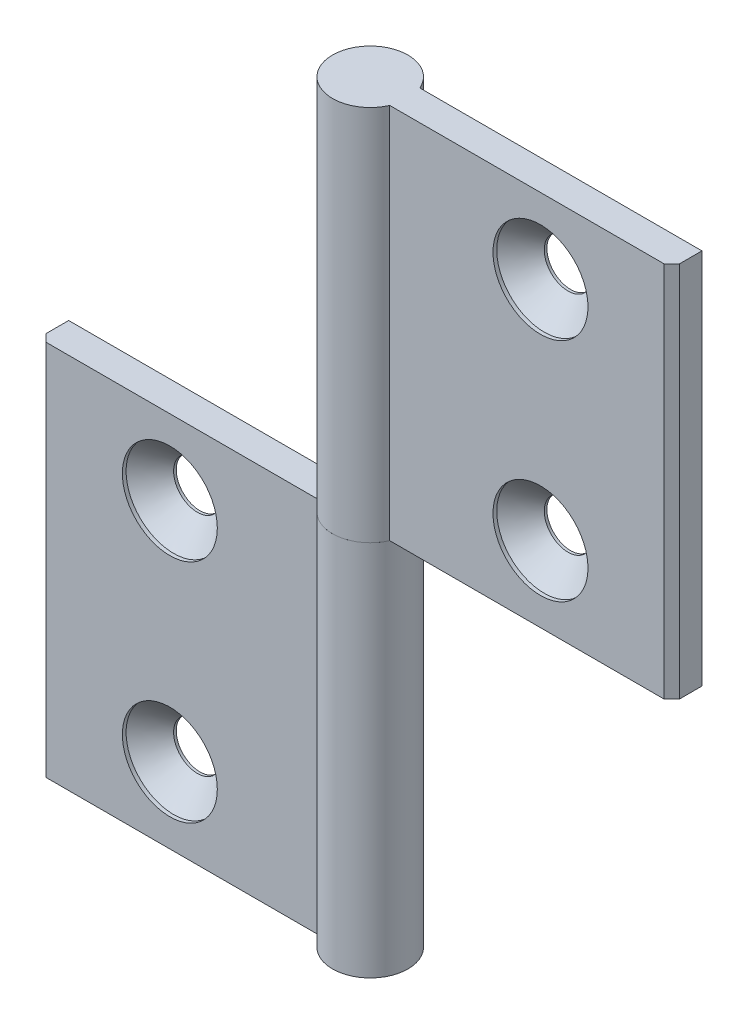
ISO-10303-21;
HEADER;
FILE_DESCRIPTION(('STEP AP214'),'2;1');
FILE_NAME('part.step','',(''),(''),'','','');
FILE_SCHEMA(('AUTOMOTIVE_DESIGN { 1 0 10303 214 1 1 1 1 }'));
ENDSEC;
DATA;
#1=APPLICATION_CONTEXT('core data for automotive mechanical design processes');
#2=APPLICATION_PROTOCOL_DEFINITION('international standard','automotive_design',2000,#1);
#3=PRODUCT_CONTEXT('',#1,'mechanical');
#4=PRODUCT('Part','Part','',(#3));
#5=PRODUCT_RELATED_PRODUCT_CATEGORY('part','',(#4));
#6=PRODUCT_DEFINITION_FORMATION('','',#4);
#7=PRODUCT_DEFINITION_CONTEXT('part definition',#1,'design');
#8=PRODUCT_DEFINITION('design','',#6,#7);
#9=PRODUCT_DEFINITION_SHAPE('','',#8);
#10=(LENGTH_UNIT() NAMED_UNIT(*) SI_UNIT(.MILLI.,.METRE.));
#11=(NAMED_UNIT(*) PLANE_ANGLE_UNIT() SI_UNIT($,.RADIAN.));
#12=(NAMED_UNIT(*) SI_UNIT($,.STERADIAN.) SOLID_ANGLE_UNIT());
#13=UNCERTAINTY_MEASURE_WITH_UNIT(LENGTH_MEASURE(1.E-05),#10,'distance_accuracy_value','');
#14=(GEOMETRIC_REPRESENTATION_CONTEXT(3) GLOBAL_UNCERTAINTY_ASSIGNED_CONTEXT((#13)) GLOBAL_UNIT_ASSIGNED_CONTEXT((#10,
#11,#12)) REPRESENTATION_CONTEXT('',''));
#15=CARTESIAN_POINT('',(0.,0.,0.));
#16=DIRECTION('',(0.,0.,1.));
#17=DIRECTION('',(1.,0.,0.));
#18=AXIS2_PLACEMENT_3D('',#15,#16,#17);
#19=CARTESIAN_POINT('',(0.,25.,0.));
#20=DIRECTION('',(0.,1.,0.));
#21=DIRECTION('',(0.,0.,-1.));
#22=AXIS2_PLACEMENT_3D('',#19,#20,#21);
#23=CYLINDRICAL_SURFACE('',#22,5.);
#24=CARTESIAN_POINT('',(0.,75.,0.));
#25=DIRECTION('',(0.,-1.,0.));
#26=DIRECTION('',(0.,0.,1.));
#27=AXIS2_PLACEMENT_3D('',#24,#25,#26);
#28=CIRCLE('',#27,5.);
#29=CARTESIAN_POINT('',(4.58257569495585,75.,1.99999999999997));
#30=VERTEX_POINT('',#29);
#31=CARTESIAN_POINT('',(4.58257569495582,75.,-2.00000000000004));
#32=VERTEX_POINT('',#31);
#33=EDGE_CURVE('E120',#30,#32,#28,.T.);
#34=ORIENTED_EDGE('',*,*,#33,.T.);
#35=DIRECTION('',(0.,1.,0.));
#36=VECTOR('',#35,1.);
#37=CARTESIAN_POINT('',(4.58257569495582,25.,-2.00000000000004));
#38=LINE('',#37,#36);
#39=CARTESIAN_POINT('',(4.58257569495582,25.,-2.00000000000004));
#40=VERTEX_POINT('',#39);
#41=EDGE_CURVE('E12',#40,#32,#38,.T.);
#42=ORIENTED_EDGE('',*,*,#41,.F.);
#43=CARTESIAN_POINT('',(0.,25.,0.));
#44=DIRECTION('',(0.,-1.,0.));
#45=DIRECTION('',(0.,0.,1.));
#46=AXIS2_PLACEMENT_3D('',#43,#44,#45);
#47=CIRCLE('',#46,5.);
#48=CARTESIAN_POINT('',(4.58257569495585,25.,1.99999999999997));
#49=VERTEX_POINT('',#48);
#50=EDGE_CURVE('E129',#49,#40,#47,.T.);
#51=ORIENTED_EDGE('',*,*,#50,.F.);
#52=DIRECTION('',(0.,1.,0.));
#53=VECTOR('',#52,1.);
#54=CARTESIAN_POINT('',(4.58257569495585,25.,1.99999999999997));
#55=LINE('',#54,#53);
#56=EDGE_CURVE('E116',#49,#30,#55,.T.);
#57=ORIENTED_EDGE('',*,*,#56,.T.);
#58=EDGE_LOOP('',(#34,#42,#51,#57));
#59=FACE_BOUND('',#58,.T.);
#60=ADVANCED_FACE('F44',(#59),#23,.T.);
#61=CARTESIAN_POINT('',(4.58257569495582,25.,-2.00000000000004));
#62=DIRECTION('',(0.,0.,1.));
#63=DIRECTION('',(-1.,0.,0.));
#64=AXIS2_PLACEMENT_3D('',#61,#62,#63);
#65=PLANE('',#64);
#66=CARTESIAN_POINT('',(24.5825756949558,35.,-2.00000000000018));
#67=DIRECTION('',(0.,0.,1.));
#68=DIRECTION('',(-1.,0.,0.));
#69=AXIS2_PLACEMENT_3D('',#66,#67,#68);
#70=CIRCLE('',#69,3.15);
#71=CARTESIAN_POINT('',(21.4325756949558,35.,-2.00000000000016));
#72=VERTEX_POINT('',#71);
#73=EDGE_CURVE('E47',#72,#72,#70,.T.);
#74=ORIENTED_EDGE('',*,*,#73,.T.);
#75=EDGE_LOOP('',(#74));
#76=FACE_BOUND('',#75,.T.);
#77=CARTESIAN_POINT('',(24.5825756949558,65.,-2.00000000000018));
#78=DIRECTION('',(0.,0.,1.));
#79=DIRECTION('',(-1.,0.,0.));
#80=AXIS2_PLACEMENT_3D('',#77,#78,#79);
#81=CIRCLE('',#80,3.15);
#82=CARTESIAN_POINT('',(21.4325756949558,65.,-2.00000000000016));
#83=VERTEX_POINT('',#82);
#84=EDGE_CURVE('E124',#83,#83,#81,.T.);
#85=ORIENTED_EDGE('',*,*,#84,.T.);
#86=EDGE_LOOP('',(#85));
#87=FACE_BOUND('',#86,.T.);
#88=DIRECTION('',(1.,0.,0.));
#89=VECTOR('',#88,1.);
#90=CARTESIAN_POINT('',(4.58257569495582,75.,-2.00000000000004));
#91=LINE('',#90,#89);
#92=CARTESIAN_POINT('',(42.,75.,-2.00000000000031));
#93=VERTEX_POINT('',#92);
#94=EDGE_CURVE('E123',#32,#93,#91,.T.);
#95=ORIENTED_EDGE('',*,*,#94,.T.);
#96=DIRECTION('',(0.,1.,0.));
#97=VECTOR('',#96,1.);
#98=CARTESIAN_POINT('',(42.,25.,-2.00000000000031));
#99=LINE('',#98,#97);
#100=CARTESIAN_POINT('',(42.,25.,-2.00000000000031));
#101=VERTEX_POINT('',#100);
#102=EDGE_CURVE('E53',#101,#93,#99,.T.);
#103=ORIENTED_EDGE('',*,*,#102,.F.);
#104=DIRECTION('',(1.,0.,0.));
#105=VECTOR('',#104,1.);
#106=CARTESIAN_POINT('',(4.58257569495582,25.,-2.00000000000004));
#107=LINE('',#106,#105);
#108=EDGE_CURVE('E96',#40,#101,#107,.T.);
#109=ORIENTED_EDGE('',*,*,#108,.F.);
#110=ORIENTED_EDGE('',*,*,#41,.T.);
#111=EDGE_LOOP('',(#95,#103,#109,#110));
#112=FACE_BOUND('',#111,.T.);
#113=ADVANCED_FACE('F150',(#76,#87,#112),#65,.F.);
#114=CARTESIAN_POINT('',(42.,25.,-2.00000000000031));
#115=DIRECTION('',(-1.,0.,0.));
#116=DIRECTION('',(0.,0.,-1.));
#117=AXIS2_PLACEMENT_3D('',#114,#115,#116);
#118=PLANE('',#117);
#119=DIRECTION('',(0.,0.,1.));
#120=VECTOR('',#119,1.);
#121=CARTESIAN_POINT('',(42.,75.,-2.00000000000031));
#122=LINE('',#121,#120);
#123=CARTESIAN_POINT('',(42.,75.,0.99999999999969));
#124=VERTEX_POINT('',#123);
#125=EDGE_CURVE('E111',#93,#124,#122,.T.);
#126=ORIENTED_EDGE('',*,*,#125,.T.);
#127=DIRECTION('',(0.,1.,0.));
#128=VECTOR('',#127,1.);
#129=CARTESIAN_POINT('',(42.,25.,0.99999999999969));
#130=LINE('',#129,#128);
#131=CARTESIAN_POINT('',(42.,25.,0.99999999999969));
#132=VERTEX_POINT('',#131);
#133=EDGE_CURVE('E108',#132,#124,#130,.T.);
#134=ORIENTED_EDGE('',*,*,#133,.F.);
#135=DIRECTION('',(0.,0.,1.));
#136=VECTOR('',#135,1.);
#137=CARTESIAN_POINT('',(42.,25.,-2.00000000000031));
#138=LINE('',#137,#136);
#139=EDGE_CURVE('E100',#101,#132,#138,.T.);
#140=ORIENTED_EDGE('',*,*,#139,.F.);
#141=ORIENTED_EDGE('',*,*,#102,.T.);
#142=EDGE_LOOP('',(#126,#134,#140,#141));
#143=FACE_BOUND('',#142,.T.);
#144=ADVANCED_FACE('F109',(#143),#118,.F.);
#145=CARTESIAN_POINT('',(42.,25.,0.99999999999969));
#146=DIRECTION('',(-0.70710678118655,0.,-0.707106781186545));
#147=DIRECTION('',(0.707106781186545,0.,-0.70710678118655));
#148=AXIS2_PLACEMENT_3D('',#145,#146,#147);
#149=PLANE('',#148);
#150=DIRECTION('',(-0.707106781186545,0.,0.70710678118655));
#151=VECTOR('',#150,1.);
#152=CARTESIAN_POINT('',(42.,75.,0.99999999999969));
#153=LINE('',#152,#151);
#154=CARTESIAN_POINT('',(41.,75.,1.99999999999969));
#155=VERTEX_POINT('',#154);
#156=EDGE_CURVE('E82',#124,#155,#153,.T.);
#157=ORIENTED_EDGE('',*,*,#156,.T.);
#158=DIRECTION('',(0.,1.,0.));
#159=VECTOR('',#158,1.);
#160=CARTESIAN_POINT('',(41.,25.,1.99999999999969));
#161=LINE('',#160,#159);
#162=CARTESIAN_POINT('',(41.,25.,1.99999999999969));
#163=VERTEX_POINT('',#162);
#164=EDGE_CURVE('E112',#163,#155,#161,.T.);
#165=ORIENTED_EDGE('',*,*,#164,.F.);
#166=DIRECTION('',(-0.707106781186545,0.,0.70710678118655));
#167=VECTOR('',#166,1.);
#168=CARTESIAN_POINT('',(42.,25.,0.99999999999969));
#169=LINE('',#168,#167);
#170=EDGE_CURVE('E104',#132,#163,#169,.T.);
#171=ORIENTED_EDGE('',*,*,#170,.F.);
#172=ORIENTED_EDGE('',*,*,#133,.T.);
#173=EDGE_LOOP('',(#157,#165,#171,#172));
#174=FACE_BOUND('',#173,.T.);
#175=ADVANCED_FACE('F114',(#174),#149,.F.);
#176=CARTESIAN_POINT('',(41.,25.,1.99999999999969));
#177=DIRECTION('',(0.,0.,-1.));
#178=DIRECTION('',(1.,0.,0.));
#179=AXIS2_PLACEMENT_3D('',#176,#177,#178);
#180=PLANE('',#179);
#181=CARTESIAN_POINT('',(24.5825756949558,35.,1.99999999999982));
#182=DIRECTION('',(0.,0.,1.));
#183=DIRECTION('',(-1.,0.,0.));
#184=AXIS2_PLACEMENT_3D('',#181,#182,#183);
#185=CIRCLE('',#184,6.3);
#186=CARTESIAN_POINT('',(18.2825756949558,35.,1.99999999999987));
#187=VERTEX_POINT('',#186);
#188=EDGE_CURVE('E184',#187,#187,#185,.T.);
#189=ORIENTED_EDGE('',*,*,#188,.F.);
#190=EDGE_LOOP('',(#189));
#191=FACE_BOUND('',#190,.T.);
#192=CARTESIAN_POINT('',(24.5825756949558,65.,1.99999999999982));
#193=DIRECTION('',(0.,0.,1.));
#194=DIRECTION('',(-1.,0.,0.));
#195=AXIS2_PLACEMENT_3D('',#192,#193,#194);
#196=CIRCLE('',#195,6.3);
#197=CARTESIAN_POINT('',(18.2825756949558,65.,1.99999999999987));
#198=VERTEX_POINT('',#197);
#199=EDGE_CURVE('E142',#198,#198,#196,.T.);
#200=ORIENTED_EDGE('',*,*,#199,.F.);
#201=EDGE_LOOP('',(#200));
#202=FACE_BOUND('',#201,.T.);
#203=DIRECTION('',(-1.,0.,0.));
#204=VECTOR('',#203,1.);
#205=CARTESIAN_POINT('',(41.,75.,1.99999999999969));
#206=LINE('',#205,#204);
#207=EDGE_CURVE('E88',#155,#30,#206,.T.);
#208=ORIENTED_EDGE('',*,*,#207,.T.);
#209=ORIENTED_EDGE('',*,*,#56,.F.);
#210=DIRECTION('',(-1.,0.,0.));
#211=VECTOR('',#210,1.);
#212=CARTESIAN_POINT('',(41.,25.,1.99999999999969));
#213=LINE('',#212,#211);
#214=EDGE_CURVE('E62',#163,#49,#213,.T.);
#215=ORIENTED_EDGE('',*,*,#214,.F.);
#216=ORIENTED_EDGE('',*,*,#164,.T.);
#217=EDGE_LOOP('',(#208,#209,#215,#216));
#218=FACE_BOUND('',#217,.T.);
#219=ADVANCED_FACE('F162',(#191,#202,#218),#180,.F.);
#220=CARTESIAN_POINT('',(0.,25.,0.));
#221=DIRECTION('',(0.,-1.,0.));
#222=DIRECTION('',(0.,0.,1.));
#223=AXIS2_PLACEMENT_3D('',#220,#221,#222);
#224=PLANE('',#223);
#225=ORIENTED_EDGE('',*,*,#50,.T.);
#226=ORIENTED_EDGE('',*,*,#108,.T.);
#227=ORIENTED_EDGE('',*,*,#139,.T.);
#228=ORIENTED_EDGE('',*,*,#170,.T.);
#229=ORIENTED_EDGE('',*,*,#214,.T.);
#230=EDGE_LOOP('',(#225,#226,#227,#228,#229));
#231=FACE_BOUND('',#230,.T.);
#232=ADVANCED_FACE('F102',(#231),#224,.T.);
#233=CARTESIAN_POINT('',(0.,75.,0.));
#234=DIRECTION('',(0.,-1.,0.));
#235=DIRECTION('',(0.,0.,1.));
#236=AXIS2_PLACEMENT_3D('',#233,#234,#235);
#237=PLANE('',#236);
#238=ORIENTED_EDGE('',*,*,#33,.F.);
#239=ORIENTED_EDGE('',*,*,#207,.F.);
#240=ORIENTED_EDGE('',*,*,#156,.F.);
#241=ORIENTED_EDGE('',*,*,#125,.F.);
#242=ORIENTED_EDGE('',*,*,#94,.F.);
#243=EDGE_LOOP('',(#238,#239,#240,#241,#242));
#244=FACE_BOUND('',#243,.T.);
#245=ADVANCED_FACE('F152',(#244),#237,.F.);
#246=CARTESIAN_POINT('',(24.5825756949558,65.,1.99999999999982));
#247=DIRECTION('',(0.,0.,1.));
#248=DIRECTION('',(-1.,0.,0.));
#249=AXIS2_PLACEMENT_3D('',#246,#247,#248);
#250=CYLINDRICAL_SURFACE('',#249,3.15);
#251=CARTESIAN_POINT('',(24.5825756949558,65.,-1.65000000000018));
#252=DIRECTION('',(0.,0.,1.));
#253=DIRECTION('',(-1.,0.,0.));
#254=AXIS2_PLACEMENT_3D('',#251,#252,#253);
#255=CIRCLE('',#254,3.15);
#256=CARTESIAN_POINT('',(21.4325756949558,65.,-1.65000000000016));
#257=VERTEX_POINT('',#256);
#258=EDGE_CURVE('E133',#257,#257,#255,.T.);
#259=ORIENTED_EDGE('',*,*,#258,.T.);
#260=EDGE_LOOP('',(#259));
#261=FACE_BOUND('',#260,.T.);
#262=ORIENTED_EDGE('',*,*,#84,.F.);
#263=EDGE_LOOP('',(#262));
#264=FACE_BOUND('',#263,.T.);
#265=ADVANCED_FACE('F154',(#261,#264),#250,.F.);
#266=CARTESIAN_POINT('',(24.5825756949558,65.,1.49999999999982));
#267=DIRECTION('',(0.,0.,1.));
#268=DIRECTION('',(-1.,0.,0.));
#269=AXIS2_PLACEMENT_3D('',#266,#267,#268);
#270=CONICAL_SURFACE('',#269,6.3,0.785398163397449);
#271=ORIENTED_EDGE('',*,*,#258,.F.);
#272=EDGE_LOOP('',(#271));
#273=FACE_BOUND('',#272,.T.);
#274=CARTESIAN_POINT('',(24.5825756949558,65.,1.49999999999982));
#275=DIRECTION('',(0.,0.,1.));
#276=DIRECTION('',(-1.,0.,0.));
#277=AXIS2_PLACEMENT_3D('',#274,#275,#276);
#278=CIRCLE('',#277,6.3);
#279=CARTESIAN_POINT('',(18.2825756949558,65.,1.49999999999986));
#280=VERTEX_POINT('',#279);
#281=EDGE_CURVE('E137',#280,#280,#278,.T.);
#282=ORIENTED_EDGE('',*,*,#281,.T.);
#283=EDGE_LOOP('',(#282));
#284=FACE_BOUND('',#283,.T.);
#285=ADVANCED_FACE('F160',(#273,#284),#270,.F.);
#286=CARTESIAN_POINT('',(24.5825756949558,65.,1.99999999999982));
#287=DIRECTION('',(0.,0.,1.));
#288=DIRECTION('',(-1.,0.,0.));
#289=AXIS2_PLACEMENT_3D('',#286,#287,#288);
#290=CYLINDRICAL_SURFACE('',#289,6.3);
#291=ORIENTED_EDGE('',*,*,#281,.F.);
#292=EDGE_LOOP('',(#291));
#293=FACE_BOUND('',#292,.T.);
#294=ORIENTED_EDGE('',*,*,#199,.T.);
#295=EDGE_LOOP('',(#294));
#296=FACE_BOUND('',#295,.T.);
#297=ADVANCED_FACE('F211',(#293,#296),#290,.F.);
#298=CARTESIAN_POINT('',(24.5825756949558,35.,1.99999999999982));
#299=DIRECTION('',(0.,0.,1.));
#300=DIRECTION('',(-1.,0.,0.));
#301=AXIS2_PLACEMENT_3D('',#298,#299,#300);
#302=CYLINDRICAL_SURFACE('',#301,3.15);
#303=CARTESIAN_POINT('',(24.5825756949558,35.,-1.65000000000018));
#304=DIRECTION('',(0.,0.,1.));
#305=DIRECTION('',(-1.,0.,0.));
#306=AXIS2_PLACEMENT_3D('',#303,#304,#305);
#307=CIRCLE('',#306,3.15);
#308=CARTESIAN_POINT('',(21.4325756949558,35.,-1.65000000000016));
#309=VERTEX_POINT('',#308);
#310=EDGE_CURVE('E188',#309,#309,#307,.T.);
#311=ORIENTED_EDGE('',*,*,#310,.T.);
#312=EDGE_LOOP('',(#311));
#313=FACE_BOUND('',#312,.T.);
#314=ORIENTED_EDGE('',*,*,#73,.F.);
#315=EDGE_LOOP('',(#314));
#316=FACE_BOUND('',#315,.T.);
#317=ADVANCED_FACE('F204',(#313,#316),#302,.F.);
#318=CARTESIAN_POINT('',(24.5825756949558,35.,1.49999999999982));
#319=DIRECTION('',(0.,0.,1.));
#320=DIRECTION('',(-1.,0.,0.));
#321=AXIS2_PLACEMENT_3D('',#318,#319,#320);
#322=CONICAL_SURFACE('',#321,6.3,0.785398163397449);
#323=ORIENTED_EDGE('',*,*,#310,.F.);
#324=EDGE_LOOP('',(#323));
#325=FACE_BOUND('',#324,.T.);
#326=CARTESIAN_POINT('',(24.5825756949558,35.,1.49999999999982));
#327=DIRECTION('',(0.,0.,1.));
#328=DIRECTION('',(-1.,0.,0.));
#329=AXIS2_PLACEMENT_3D('',#326,#327,#328);
#330=CIRCLE('',#329,6.3);
#331=CARTESIAN_POINT('',(18.2825756949558,35.,1.49999999999986));
#332=VERTEX_POINT('',#331);
#333=EDGE_CURVE('E192',#332,#332,#330,.T.);
#334=ORIENTED_EDGE('',*,*,#333,.T.);
#335=EDGE_LOOP('',(#334));
#336=FACE_BOUND('',#335,.T.);
#337=ADVANCED_FACE('F198',(#325,#336),#322,.F.);
#338=CARTESIAN_POINT('',(24.5825756949558,35.,1.99999999999982));
#339=DIRECTION('',(0.,0.,1.));
#340=DIRECTION('',(-1.,0.,0.));
#341=AXIS2_PLACEMENT_3D('',#338,#339,#340);
#342=CYLINDRICAL_SURFACE('',#341,6.3);
#343=ORIENTED_EDGE('',*,*,#333,.F.);
#344=EDGE_LOOP('',(#343));
#345=FACE_BOUND('',#344,.T.);
#346=ORIENTED_EDGE('',*,*,#188,.T.);
#347=EDGE_LOOP('',(#346));
#348=FACE_BOUND('',#347,.T.);
#349=ADVANCED_FACE('F196',(#345,#348),#342,.F.);
#350=CLOSED_SHELL('',(#60,#113,#144,#175,#219,#232,#245,#265,#285,#297,#317,#337,#349));
#351=MANIFOLD_SOLID_BREP('B2',#350);
#352=CARTESIAN_POINT('',(0.,25.,0.));
#353=DIRECTION('',(0.,-1.,0.));
#354=DIRECTION('',(0.,0.,-1.));
#355=AXIS2_PLACEMENT_3D('',#352,#353,#354);
#356=CYLINDRICAL_SURFACE('',#355,5.);
#357=CARTESIAN_POINT('',(0.,-25.,0.));
#358=DIRECTION('',(0.,1.,0.));
#359=DIRECTION('',(0.,0.,1.));
#360=AXIS2_PLACEMENT_3D('',#357,#358,#359);
#361=CIRCLE('',#360,5.);
#362=CARTESIAN_POINT('',(-4.58257569495584,-25.,2.));
#363=VERTEX_POINT('',#362);
#364=CARTESIAN_POINT('',(-4.58257569495584,-25.,-2.));
#365=VERTEX_POINT('',#364);
#366=EDGE_CURVE('E371',#363,#365,#361,.T.);
#367=ORIENTED_EDGE('',*,*,#366,.T.);
#368=DIRECTION('',(0.,-1.,0.));
#369=VECTOR('',#368,1.);
#370=CARTESIAN_POINT('',(-4.58257569495584,25.,-2.));
#371=LINE('',#370,#369);
#372=CARTESIAN_POINT('',(-4.58257569495584,25.,-2.));
#373=VERTEX_POINT('',#372);
#374=EDGE_CURVE('E42',#373,#365,#371,.T.);
#375=ORIENTED_EDGE('',*,*,#374,.F.);
#376=CARTESIAN_POINT('',(0.,25.,0.));
#377=DIRECTION('',(0.,1.,0.));
#378=DIRECTION('',(0.,0.,1.));
#379=AXIS2_PLACEMENT_3D('',#376,#377,#378);
#380=CIRCLE('',#379,5.);
#381=CARTESIAN_POINT('',(-4.58257569495584,25.,2.));
#382=VERTEX_POINT('',#381);
#383=EDGE_CURVE('E380',#382,#373,#380,.T.);
#384=ORIENTED_EDGE('',*,*,#383,.F.);
#385=DIRECTION('',(0.,-1.,0.));
#386=VECTOR('',#385,1.);
#387=CARTESIAN_POINT('',(-4.58257569495584,25.,2.));
#388=LINE('',#387,#386);
#389=EDGE_CURVE('E367',#382,#363,#388,.T.);
#390=ORIENTED_EDGE('',*,*,#389,.T.);
#391=EDGE_LOOP('',(#367,#375,#384,#390));
#392=FACE_BOUND('',#391,.T.);
#393=ADVANCED_FACE('F295',(#392),#356,.T.);
#394=CARTESIAN_POINT('',(-4.58257569495584,25.,-2.));
#395=DIRECTION('',(0.,0.,1.));
#396=DIRECTION('',(1.,0.,0.));
#397=AXIS2_PLACEMENT_3D('',#394,#395,#396);
#398=PLANE('',#397);
#399=CARTESIAN_POINT('',(-24.5825756949558,15.,-2.));
#400=DIRECTION('',(0.,0.,1.));
#401=DIRECTION('',(1.,0.,0.));
#402=AXIS2_PLACEMENT_3D('',#399,#400,#401);
#403=CIRCLE('',#402,3.15);
#404=CARTESIAN_POINT('',(-21.4325756949558,15.,-2.));
#405=VERTEX_POINT('',#404);
#406=EDGE_CURVE('E298',#405,#405,#403,.T.);
#407=ORIENTED_EDGE('',*,*,#406,.T.);
#408=EDGE_LOOP('',(#407));
#409=FACE_BOUND('',#408,.T.);
#410=CARTESIAN_POINT('',(-24.5825756949558,-15.,-2.));
#411=DIRECTION('',(0.,0.,1.));
#412=DIRECTION('',(1.,0.,0.));
#413=AXIS2_PLACEMENT_3D('',#410,#411,#412);
#414=CIRCLE('',#413,3.15);
#415=CARTESIAN_POINT('',(-21.4325756949558,-15.,-2.));
#416=VERTEX_POINT('',#415);
#417=EDGE_CURVE('E375',#416,#416,#414,.T.);
#418=ORIENTED_EDGE('',*,*,#417,.T.);
#419=EDGE_LOOP('',(#418));
#420=FACE_BOUND('',#419,.T.);
#421=DIRECTION('',(-1.,0.,0.));
#422=VECTOR('',#421,1.);
#423=CARTESIAN_POINT('',(-4.58257569495584,-25.,-2.));
#424=LINE('',#423,#422);
#425=CARTESIAN_POINT('',(-42.,-25.,-2.));
#426=VERTEX_POINT('',#425);
#427=EDGE_CURVE('E374',#365,#426,#424,.T.);
#428=ORIENTED_EDGE('',*,*,#427,.T.);
#429=DIRECTION('',(0.,-1.,0.));
#430=VECTOR('',#429,1.);
#431=CARTESIAN_POINT('',(-42.,25.,-2.));
#432=LINE('',#431,#430);
#433=CARTESIAN_POINT('',(-42.,25.,-2.));
#434=VERTEX_POINT('',#433);
#435=EDGE_CURVE('E304',#434,#426,#432,.T.);
#436=ORIENTED_EDGE('',*,*,#435,.F.);
#437=DIRECTION('',(-1.,0.,0.));
#438=VECTOR('',#437,1.);
#439=CARTESIAN_POINT('',(-4.58257569495584,25.,-2.));
#440=LINE('',#439,#438);
#441=EDGE_CURVE('E347',#373,#434,#440,.T.);
#442=ORIENTED_EDGE('',*,*,#441,.F.);
#443=ORIENTED_EDGE('',*,*,#374,.T.);
#444=EDGE_LOOP('',(#428,#436,#442,#443));
#445=FACE_BOUND('',#444,.T.);
#446=ADVANCED_FACE('F401',(#409,#420,#445),#398,.F.);
#447=CARTESIAN_POINT('',(-42.,25.,-2.));
#448=DIRECTION('',(1.,0.,0.));
#449=DIRECTION('',(0.,0.,-1.));
#450=AXIS2_PLACEMENT_3D('',#447,#448,#449);
#451=PLANE('',#450);
#452=DIRECTION('',(0.,0.,1.));
#453=VECTOR('',#452,1.);
#454=CARTESIAN_POINT('',(-42.,-25.,-2.));
#455=LINE('',#454,#453);
#456=CARTESIAN_POINT('',(-42.,-25.,1.));
#457=VERTEX_POINT('',#456);
#458=EDGE_CURVE('E362',#426,#457,#455,.T.);
#459=ORIENTED_EDGE('',*,*,#458,.T.);
#460=DIRECTION('',(0.,-1.,0.));
#461=VECTOR('',#460,1.);
#462=CARTESIAN_POINT('',(-42.,25.,1.));
#463=LINE('',#462,#461);
#464=CARTESIAN_POINT('',(-42.,25.,1.));
#465=VERTEX_POINT('',#464);
#466=EDGE_CURVE('E359',#465,#457,#463,.T.);
#467=ORIENTED_EDGE('',*,*,#466,.F.);
#468=DIRECTION('',(0.,0.,1.));
#469=VECTOR('',#468,1.);
#470=CARTESIAN_POINT('',(-42.,25.,-2.));
#471=LINE('',#470,#469);
#472=EDGE_CURVE('E351',#434,#465,#471,.T.);
#473=ORIENTED_EDGE('',*,*,#472,.F.);
#474=ORIENTED_EDGE('',*,*,#435,.T.);
#475=EDGE_LOOP('',(#459,#467,#473,#474));
#476=FACE_BOUND('',#475,.T.);
#477=ADVANCED_FACE('F360',(#476),#451,.F.);
#478=CARTESIAN_POINT('',(-42.,25.,1.));
#479=DIRECTION('',(0.707106781186544,0.,-0.707106781186551));
#480=DIRECTION('',(-0.707106781186551,0.,-0.707106781186544));
#481=AXIS2_PLACEMENT_3D('',#478,#479,#480);
#482=PLANE('',#481);
#483=DIRECTION('',(0.707106781186551,0.,0.707106781186544));
#484=VECTOR('',#483,1.);
#485=CARTESIAN_POINT('',(-42.,-25.,1.));
#486=LINE('',#485,#484);
#487=CARTESIAN_POINT('',(-41.,-25.,2.));
#488=VERTEX_POINT('',#487);
#489=EDGE_CURVE('E333',#457,#488,#486,.T.);
#490=ORIENTED_EDGE('',*,*,#489,.T.);
#491=DIRECTION('',(0.,-1.,0.));
#492=VECTOR('',#491,1.);
#493=CARTESIAN_POINT('',(-41.,25.,2.));
#494=LINE('',#493,#492);
#495=CARTESIAN_POINT('',(-41.,25.,2.));
#496=VERTEX_POINT('',#495);
#497=EDGE_CURVE('E363',#496,#488,#494,.T.);
#498=ORIENTED_EDGE('',*,*,#497,.F.);
#499=DIRECTION('',(0.707106781186551,0.,0.707106781186544));
#500=VECTOR('',#499,1.);
#501=CARTESIAN_POINT('',(-42.,25.,1.));
#502=LINE('',#501,#500);
#503=EDGE_CURVE('E355',#465,#496,#502,.T.);
#504=ORIENTED_EDGE('',*,*,#503,.F.);
#505=ORIENTED_EDGE('',*,*,#466,.T.);
#506=EDGE_LOOP('',(#490,#498,#504,#505));
#507=FACE_BOUND('',#506,.T.);
#508=ADVANCED_FACE('F365',(#507),#482,.F.);
#509=CARTESIAN_POINT('',(-41.,25.,2.));
#510=DIRECTION('',(0.,0.,-1.));
#511=DIRECTION('',(-1.,0.,0.));
#512=AXIS2_PLACEMENT_3D('',#509,#510,#511);
#513=PLANE('',#512);
#514=CARTESIAN_POINT('',(-24.5825756949558,15.,2.));
#515=DIRECTION('',(0.,0.,1.));
#516=DIRECTION('',(1.,0.,0.));
#517=AXIS2_PLACEMENT_3D('',#514,#515,#516);
#518=CIRCLE('',#517,6.3);
#519=CARTESIAN_POINT('',(-18.2825756949558,15.,2.));
#520=VERTEX_POINT('',#519);
#521=EDGE_CURVE('E435',#520,#520,#518,.T.);
#522=ORIENTED_EDGE('',*,*,#521,.F.);
#523=EDGE_LOOP('',(#522));
#524=FACE_BOUND('',#523,.T.);
#525=CARTESIAN_POINT('',(-24.5825756949558,-15.,2.));
#526=DIRECTION('',(0.,0.,1.));
#527=DIRECTION('',(1.,0.,0.));
#528=AXIS2_PLACEMENT_3D('',#525,#526,#527);
#529=CIRCLE('',#528,6.3);
#530=CARTESIAN_POINT('',(-18.2825756949558,-15.,2.));
#531=VERTEX_POINT('',#530);
#532=EDGE_CURVE('E393',#531,#531,#529,.T.);
#533=ORIENTED_EDGE('',*,*,#532,.F.);
#534=EDGE_LOOP('',(#533));
#535=FACE_BOUND('',#534,.T.);
#536=DIRECTION('',(1.,0.,0.));
#537=VECTOR('',#536,1.);
#538=CARTESIAN_POINT('',(-41.,-25.,2.));
#539=LINE('',#538,#537);
#540=EDGE_CURVE('E339',#488,#363,#539,.T.);
#541=ORIENTED_EDGE('',*,*,#540,.T.);
#542=ORIENTED_EDGE('',*,*,#389,.F.);
#543=DIRECTION('',(1.,0.,0.));
#544=VECTOR('',#543,1.);
#545=CARTESIAN_POINT('',(-41.,25.,2.));
#546=LINE('',#545,#544);
#547=EDGE_CURVE('E313',#496,#382,#546,.T.);
#548=ORIENTED_EDGE('',*,*,#547,.F.);
#549=ORIENTED_EDGE('',*,*,#497,.T.);
#550=EDGE_LOOP('',(#541,#542,#548,#549));
#551=FACE_BOUND('',#550,.T.);
#552=ADVANCED_FACE('F413',(#524,#535,#551),#513,.F.);
#553=CARTESIAN_POINT('',(0.,25.,0.));
#554=DIRECTION('',(0.,1.,0.));
#555=DIRECTION('',(0.,0.,1.));
#556=AXIS2_PLACEMENT_3D('',#553,#554,#555);
#557=PLANE('',#556);
#558=ORIENTED_EDGE('',*,*,#383,.T.);
#559=ORIENTED_EDGE('',*,*,#441,.T.);
#560=ORIENTED_EDGE('',*,*,#472,.T.);
#561=ORIENTED_EDGE('',*,*,#503,.T.);
#562=ORIENTED_EDGE('',*,*,#547,.T.);
#563=EDGE_LOOP('',(#558,#559,#560,#561,#562));
#564=FACE_BOUND('',#563,.T.);
#565=ADVANCED_FACE('F353',(#564),#557,.T.);
#566=CARTESIAN_POINT('',(0.,-25.,0.));
#567=DIRECTION('',(0.,1.,0.));
#568=DIRECTION('',(0.,0.,1.));
#569=AXIS2_PLACEMENT_3D('',#566,#567,#568);
#570=PLANE('',#569);
#571=ORIENTED_EDGE('',*,*,#366,.F.);
#572=ORIENTED_EDGE('',*,*,#540,.F.);
#573=ORIENTED_EDGE('',*,*,#489,.F.);
#574=ORIENTED_EDGE('',*,*,#458,.F.);
#575=ORIENTED_EDGE('',*,*,#427,.F.);
#576=EDGE_LOOP('',(#571,#572,#573,#574,#575));
#577=FACE_BOUND('',#576,.T.);
#578=ADVANCED_FACE('F403',(#577),#570,.F.);
#579=CARTESIAN_POINT('',(-24.5825756949558,-15.,2.));
#580=DIRECTION('',(0.,0.,1.));
#581=DIRECTION('',(1.,0.,0.));
#582=AXIS2_PLACEMENT_3D('',#579,#580,#581);
#583=CYLINDRICAL_SURFACE('',#582,3.15);
#584=CARTESIAN_POINT('',(-24.5825756949558,-15.,-1.65));
#585=DIRECTION('',(0.,0.,1.));
#586=DIRECTION('',(1.,0.,0.));
#587=AXIS2_PLACEMENT_3D('',#584,#585,#586);
#588=CIRCLE('',#587,3.15);
#589=CARTESIAN_POINT('',(-21.4325756949558,-15.,-1.65));
#590=VERTEX_POINT('',#589);
#591=EDGE_CURVE('E384',#590,#590,#588,.T.);
#592=ORIENTED_EDGE('',*,*,#591,.T.);
#593=EDGE_LOOP('',(#592));
#594=FACE_BOUND('',#593,.T.);
#595=ORIENTED_EDGE('',*,*,#417,.F.);
#596=EDGE_LOOP('',(#595));
#597=FACE_BOUND('',#596,.T.);
#598=ADVANCED_FACE('F405',(#594,#597),#583,.F.);
#599=CARTESIAN_POINT('',(-24.5825756949558,-15.,1.5));
#600=DIRECTION('',(0.,0.,1.));
#601=DIRECTION('',(1.,0.,0.));
#602=AXIS2_PLACEMENT_3D('',#599,#600,#601);
#603=CONICAL_SURFACE('',#602,6.3,0.785398163397449);
#604=ORIENTED_EDGE('',*,*,#591,.F.);
#605=EDGE_LOOP('',(#604));
#606=FACE_BOUND('',#605,.T.);
#607=CARTESIAN_POINT('',(-24.5825756949558,-15.,1.5));
#608=DIRECTION('',(0.,0.,1.));
#609=DIRECTION('',(1.,0.,0.));
#610=AXIS2_PLACEMENT_3D('',#607,#608,#609);
#611=CIRCLE('',#610,6.3);
#612=CARTESIAN_POINT('',(-18.2825756949558,-15.,1.5));
#613=VERTEX_POINT('',#612);
#614=EDGE_CURVE('E388',#613,#613,#611,.T.);
#615=ORIENTED_EDGE('',*,*,#614,.T.);
#616=EDGE_LOOP('',(#615));
#617=FACE_BOUND('',#616,.T.);
#618=ADVANCED_FACE('F411',(#606,#617),#603,.F.);
#619=CARTESIAN_POINT('',(-24.5825756949558,-15.,2.));
#620=DIRECTION('',(0.,0.,1.));
#621=DIRECTION('',(1.,0.,0.));
#622=AXIS2_PLACEMENT_3D('',#619,#620,#621);
#623=CYLINDRICAL_SURFACE('',#622,6.3);
#624=ORIENTED_EDGE('',*,*,#614,.F.);
#625=EDGE_LOOP('',(#624));
#626=FACE_BOUND('',#625,.T.);
#627=ORIENTED_EDGE('',*,*,#532,.T.);
#628=EDGE_LOOP('',(#627));
#629=FACE_BOUND('',#628,.T.);
#630=ADVANCED_FACE('F462',(#626,#629),#623,.F.);
#631=CARTESIAN_POINT('',(-24.5825756949558,15.,2.));
#632=DIRECTION('',(0.,0.,1.));
#633=DIRECTION('',(1.,0.,0.));
#634=AXIS2_PLACEMENT_3D('',#631,#632,#633);
#635=CYLINDRICAL_SURFACE('',#634,3.15);
#636=CARTESIAN_POINT('',(-24.5825756949558,15.,-1.65));
#637=DIRECTION('',(0.,0.,1.));
#638=DIRECTION('',(1.,0.,0.));
#639=AXIS2_PLACEMENT_3D('',#636,#637,#638);
#640=CIRCLE('',#639,3.15);
#641=CARTESIAN_POINT('',(-21.4325756949558,15.,-1.65));
#642=VERTEX_POINT('',#641);
#643=EDGE_CURVE('E439',#642,#642,#640,.T.);
#644=ORIENTED_EDGE('',*,*,#643,.T.);
#645=EDGE_LOOP('',(#644));
#646=FACE_BOUND('',#645,.T.);
#647=ORIENTED_EDGE('',*,*,#406,.F.);
#648=EDGE_LOOP('',(#647));
#649=FACE_BOUND('',#648,.T.);
#650=ADVANCED_FACE('F455',(#646,#649),#635,.F.);
#651=CARTESIAN_POINT('',(-24.5825756949558,15.,1.5));
#652=DIRECTION('',(0.,0.,1.));
#653=DIRECTION('',(1.,0.,0.));
#654=AXIS2_PLACEMENT_3D('',#651,#652,#653);
#655=CONICAL_SURFACE('',#654,6.3,0.785398163397449);
#656=ORIENTED_EDGE('',*,*,#643,.F.);
#657=EDGE_LOOP('',(#656));
#658=FACE_BOUND('',#657,.T.);
#659=CARTESIAN_POINT('',(-24.5825756949558,15.,1.5));
#660=DIRECTION('',(0.,0.,1.));
#661=DIRECTION('',(1.,0.,0.));
#662=AXIS2_PLACEMENT_3D('',#659,#660,#661);
#663=CIRCLE('',#662,6.3);
#664=CARTESIAN_POINT('',(-18.2825756949558,15.,1.5));
#665=VERTEX_POINT('',#664);
#666=EDGE_CURVE('E443',#665,#665,#663,.T.);
#667=ORIENTED_EDGE('',*,*,#666,.T.);
#668=EDGE_LOOP('',(#667));
#669=FACE_BOUND('',#668,.T.);
#670=ADVANCED_FACE('F449',(#658,#669),#655,.F.);
#671=CARTESIAN_POINT('',(-24.5825756949558,15.,2.));
#672=DIRECTION('',(0.,0.,1.));
#673=DIRECTION('',(1.,0.,0.));
#674=AXIS2_PLACEMENT_3D('',#671,#672,#673);
#675=CYLINDRICAL_SURFACE('',#674,6.3);
#676=ORIENTED_EDGE('',*,*,#666,.F.);
#677=EDGE_LOOP('',(#676));
#678=FACE_BOUND('',#677,.T.);
#679=ORIENTED_EDGE('',*,*,#521,.T.);
#680=EDGE_LOOP('',(#679));
#681=FACE_BOUND('',#680,.T.);
#682=ADVANCED_FACE('F447',(#678,#681),#675,.F.);
#683=CLOSED_SHELL('',(#393,#446,#477,#508,#552,#565,#578,#598,#618,#630,#650,#670,#682));
#684=MANIFOLD_SOLID_BREP('B6',#683);
#685=ADVANCED_BREP_SHAPE_REPRESENTATION('',(#18,#351,#684),#14);
#686=SHAPE_DEFINITION_REPRESENTATION(#9,#685);
ENDSEC;
END-ISO-10303-21;
